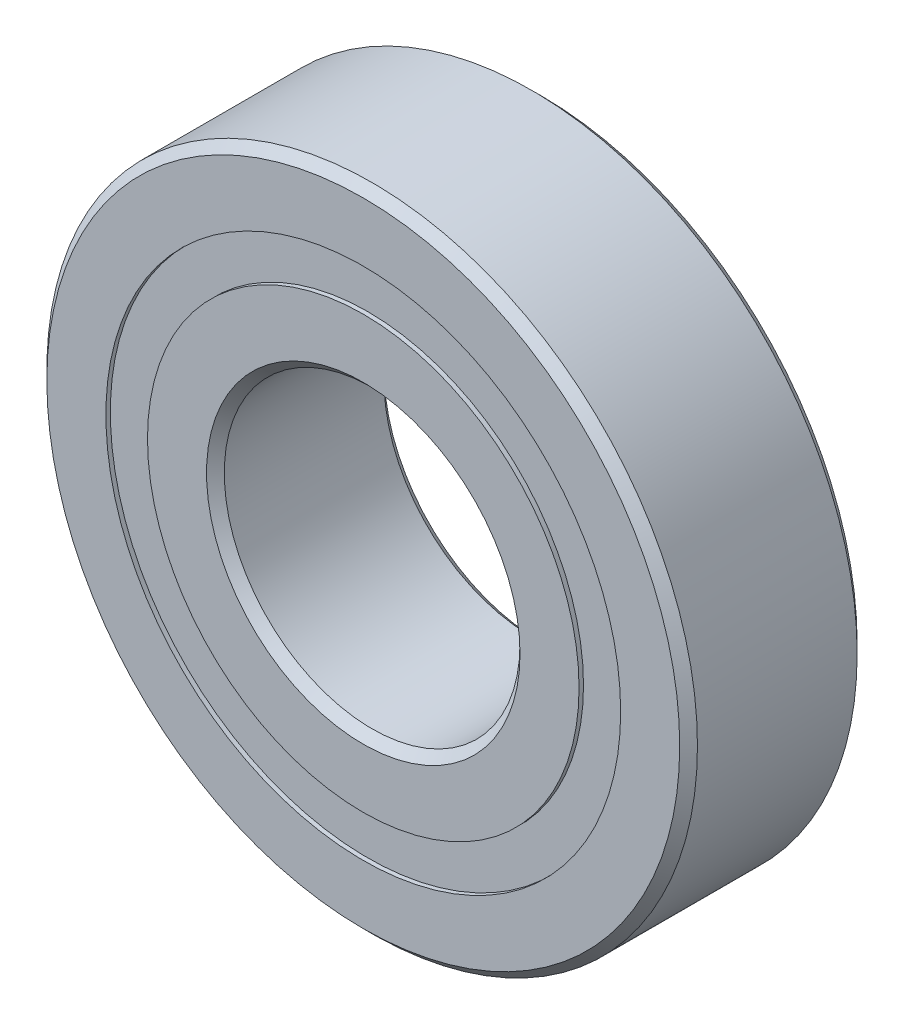
ISO-10303-21;
HEADER;
FILE_DESCRIPTION(('STEP AP214'),'2;1');
FILE_NAME('part.step','',(''),(''),'','','');
FILE_SCHEMA(('AUTOMOTIVE_DESIGN { 1 0 10303 214 1 1 1 1 }'));
ENDSEC;
DATA;
#1=APPLICATION_CONTEXT('core data for automotive mechanical design processes');
#2=APPLICATION_PROTOCOL_DEFINITION('international standard','automotive_design',2000,#1);
#3=PRODUCT_CONTEXT('',#1,'mechanical');
#4=PRODUCT('Part','Part','',(#3));
#5=PRODUCT_RELATED_PRODUCT_CATEGORY('part','',(#4));
#6=PRODUCT_DEFINITION_FORMATION('','',#4);
#7=PRODUCT_DEFINITION_CONTEXT('part definition',#1,'design');
#8=PRODUCT_DEFINITION('design','',#6,#7);
#9=PRODUCT_DEFINITION_SHAPE('','',#8);
#10=(LENGTH_UNIT() NAMED_UNIT(*) SI_UNIT(.MILLI.,.METRE.));
#11=(NAMED_UNIT(*) PLANE_ANGLE_UNIT() SI_UNIT($,.RADIAN.));
#12=(NAMED_UNIT(*) SI_UNIT($,.STERADIAN.) SOLID_ANGLE_UNIT());
#13=UNCERTAINTY_MEASURE_WITH_UNIT(LENGTH_MEASURE(1.E-05),#10,'distance_accuracy_value','');
#14=(GEOMETRIC_REPRESENTATION_CONTEXT(3) GLOBAL_UNCERTAINTY_ASSIGNED_CONTEXT((#13)) GLOBAL_UNIT_ASSIGNED_CONTEXT((#10,
#11,#12)) REPRESENTATION_CONTEXT('',''));
#15=CARTESIAN_POINT('',(0.,0.,0.));
#16=DIRECTION('',(0.,0.,1.));
#17=DIRECTION('',(1.,0.,0.));
#18=AXIS2_PLACEMENT_3D('',#15,#16,#17);
#19=CARTESIAN_POINT('',(0.,8.7032967032967,-2.85));
#20=DIRECTION('',(0.,0.,1.));
#21=DIRECTION('',(1.,0.,0.));
#22=AXIS2_PLACEMENT_3D('',#19,#20,#21);
#23=PLANE('',#22);
#24=CARTESIAN_POINT('',(0.,0.,-2.85));
#25=DIRECTION('',(0.,0.,1.));
#26=DIRECTION('',(1.,0.,0.));
#27=AXIS2_PLACEMENT_3D('',#24,#25,#26);
#28=CIRCLE('',#27,8.7032967032967);
#29=CARTESIAN_POINT('',(8.7032967032967,0.,-2.85));
#30=VERTEX_POINT('',#29);
#31=EDGE_CURVE('E57',#30,#30,#28,.T.);
#32=ORIENTED_EDGE('',*,*,#31,.F.);
#33=EDGE_LOOP('',(#32));
#34=FACE_BOUND('',#33,.T.);
#35=CARTESIAN_POINT('',(0.,0.,-2.85));
#36=DIRECTION('',(0.,0.,1.));
#37=DIRECTION('',(1.,0.,0.));
#38=AXIS2_PLACEMENT_3D('',#35,#36,#37);
#39=CIRCLE('',#38,7.2967032967033);
#40=CARTESIAN_POINT('',(7.2967032967033,0.,-2.85));
#41=VERTEX_POINT('',#40);
#42=EDGE_CURVE('E11',#41,#41,#39,.T.);
#43=ORIENTED_EDGE('',*,*,#42,.T.);
#44=EDGE_LOOP('',(#43));
#45=FACE_BOUND('',#44,.T.);
#46=ADVANCED_FACE('F43',(#34,#45),#23,.F.);
#47=CARTESIAN_POINT('',(0.,0.,3.));
#48=DIRECTION('',(0.,0.,1.));
#49=DIRECTION('',(1.,0.,0.));
#50=AXIS2_PLACEMENT_3D('',#47,#48,#49);
#51=CYLINDRICAL_SURFACE('',#50,7.2967032967033);
#52=ORIENTED_EDGE('',*,*,#42,.F.);
#53=EDGE_LOOP('',(#52));
#54=FACE_BOUND('',#53,.T.);
#55=CARTESIAN_POINT('',(0.,0.,-1.50744951180654));
#56=DIRECTION('',(0.,0.,1.));
#57=DIRECTION('',(1.,0.,0.));
#58=AXIS2_PLACEMENT_3D('',#55,#56,#57);
#59=CIRCLE('',#58,7.2967032967033);
#60=CARTESIAN_POINT('',(7.2967032967033,0.,-1.50744951180654));
#61=VERTEX_POINT('',#60);
#62=EDGE_CURVE('E49',#61,#61,#59,.T.);
#63=ORIENTED_EDGE('',*,*,#62,.T.);
#64=EDGE_LOOP('',(#63));
#65=FACE_BOUND('',#64,.T.);
#66=ADVANCED_FACE('F66',(#54,#65),#51,.F.);
#67=CARTESIAN_POINT('',(0.,8.7032967032967,-1.50744951180654));
#68=DIRECTION('',(0.,0.,-1.));
#69=DIRECTION('',(-1.,0.,0.));
#70=AXIS2_PLACEMENT_3D('',#67,#68,#69);
#71=PLANE('',#70);
#72=ORIENTED_EDGE('',*,*,#62,.F.);
#73=EDGE_LOOP('',(#72));
#74=FACE_BOUND('',#73,.T.);
#75=CARTESIAN_POINT('',(0.,0.,-1.50744951180654));
#76=DIRECTION('',(0.,0.,1.));
#77=DIRECTION('',(1.,0.,0.));
#78=AXIS2_PLACEMENT_3D('',#75,#76,#77);
#79=CIRCLE('',#78,8.7032967032967);
#80=CARTESIAN_POINT('',(8.7032967032967,0.,-1.50744951180654));
#81=VERTEX_POINT('',#80);
#82=EDGE_CURVE('E53',#81,#81,#79,.T.);
#83=ORIENTED_EDGE('',*,*,#82,.T.);
#84=EDGE_LOOP('',(#83));
#85=FACE_BOUND('',#84,.T.);
#86=ADVANCED_FACE('F70',(#74,#85),#71,.F.);
#87=CARTESIAN_POINT('',(0.,0.,3.));
#88=DIRECTION('',(0.,0.,1.));
#89=DIRECTION('',(1.,0.,0.));
#90=AXIS2_PLACEMENT_3D('',#87,#88,#89);
#91=CYLINDRICAL_SURFACE('',#90,8.7032967032967);
#92=ORIENTED_EDGE('',*,*,#82,.F.);
#93=EDGE_LOOP('',(#92));
#94=FACE_BOUND('',#93,.T.);
#95=ORIENTED_EDGE('',*,*,#31,.T.);
#96=EDGE_LOOP('',(#95));
#97=FACE_BOUND('',#96,.T.);
#98=ADVANCED_FACE('F63',(#94,#97),#91,.T.);
#99=CLOSED_SHELL('',(#46,#66,#86,#98));
#100=MANIFOLD_SOLID_BREP('B2',#99);
#101=CARTESIAN_POINT('',(0.,8.7032967032967,2.85));
#102=DIRECTION('',(0.,0.,-1.));
#103=DIRECTION('',(-1.,0.,0.));
#104=AXIS2_PLACEMENT_3D('',#101,#102,#103);
#105=PLANE('',#104);
#106=CARTESIAN_POINT('',(0.,0.,2.85));
#107=DIRECTION('',(0.,0.,1.));
#108=DIRECTION('',(1.,0.,0.));
#109=AXIS2_PLACEMENT_3D('',#106,#107,#108);
#110=CIRCLE('',#109,7.2967032967033);
#111=CARTESIAN_POINT('',(7.2967032967033,0.,2.85));
#112=VERTEX_POINT('',#111);
#113=EDGE_CURVE('E42',#112,#112,#110,.T.);
#114=ORIENTED_EDGE('',*,*,#113,.F.);
#115=EDGE_LOOP('',(#114));
#116=FACE_BOUND('',#115,.T.);
#117=CARTESIAN_POINT('',(0.,0.,2.85));
#118=DIRECTION('',(0.,0.,1.));
#119=DIRECTION('',(1.,0.,0.));
#120=AXIS2_PLACEMENT_3D('',#117,#118,#119);
#121=CIRCLE('',#120,8.7032967032967);
#122=CARTESIAN_POINT('',(8.7032967032967,0.,2.85));
#123=VERTEX_POINT('',#122);
#124=EDGE_CURVE('E124',#123,#123,#121,.T.);
#125=ORIENTED_EDGE('',*,*,#124,.T.);
#126=EDGE_LOOP('',(#125));
#127=FACE_BOUND('',#126,.T.);
#128=ADVANCED_FACE('F110',(#116,#127),#105,.F.);
#129=CARTESIAN_POINT('',(0.,0.,3.));
#130=DIRECTION('',(0.,0.,1.));
#131=DIRECTION('',(1.,0.,0.));
#132=AXIS2_PLACEMENT_3D('',#129,#130,#131);
#133=CYLINDRICAL_SURFACE('',#132,7.2967032967033);
#134=CARTESIAN_POINT('',(0.,0.,1.50744951180654));
#135=DIRECTION('',(0.,0.,1.));
#136=DIRECTION('',(1.,0.,0.));
#137=AXIS2_PLACEMENT_3D('',#134,#135,#136);
#138=CIRCLE('',#137,7.2967032967033);
#139=CARTESIAN_POINT('',(7.2967032967033,0.,1.50744951180654));
#140=VERTEX_POINT('',#139);
#141=EDGE_CURVE('E116',#140,#140,#138,.T.);
#142=ORIENTED_EDGE('',*,*,#141,.F.);
#143=EDGE_LOOP('',(#142));
#144=FACE_BOUND('',#143,.T.);
#145=ORIENTED_EDGE('',*,*,#113,.T.);
#146=EDGE_LOOP('',(#145));
#147=FACE_BOUND('',#146,.T.);
#148=ADVANCED_FACE('F139',(#144,#147),#133,.F.);
#149=CARTESIAN_POINT('',(0.,8.7032967032967,1.50744951180654));
#150=DIRECTION('',(0.,0.,1.));
#151=DIRECTION('',(1.,0.,0.));
#152=AXIS2_PLACEMENT_3D('',#149,#150,#151);
#153=PLANE('',#152);
#154=CARTESIAN_POINT('',(0.,0.,1.50744951180654));
#155=DIRECTION('',(0.,0.,1.));
#156=DIRECTION('',(1.,0.,0.));
#157=AXIS2_PLACEMENT_3D('',#154,#155,#156);
#158=CIRCLE('',#157,8.7032967032967);
#159=CARTESIAN_POINT('',(8.7032967032967,0.,1.50744951180654));
#160=VERTEX_POINT('',#159);
#161=EDGE_CURVE('E120',#160,#160,#158,.T.);
#162=ORIENTED_EDGE('',*,*,#161,.F.);
#163=EDGE_LOOP('',(#162));
#164=FACE_BOUND('',#163,.T.);
#165=ORIENTED_EDGE('',*,*,#141,.T.);
#166=EDGE_LOOP('',(#165));
#167=FACE_BOUND('',#166,.T.);
#168=ADVANCED_FACE('F134',(#164,#167),#153,.F.);
#169=CARTESIAN_POINT('',(0.,0.,3.));
#170=DIRECTION('',(0.,0.,1.));
#171=DIRECTION('',(1.,0.,0.));
#172=AXIS2_PLACEMENT_3D('',#169,#170,#171);
#173=CYLINDRICAL_SURFACE('',#172,8.7032967032967);
#174=ORIENTED_EDGE('',*,*,#124,.F.);
#175=EDGE_LOOP('',(#174));
#176=FACE_BOUND('',#175,.T.);
#177=ORIENTED_EDGE('',*,*,#161,.T.);
#178=EDGE_LOOP('',(#177));
#179=FACE_BOUND('',#178,.T.);
#180=ADVANCED_FACE('F131',(#176,#179),#173,.T.);
#181=CLOSED_SHELL('',(#128,#148,#168,#180));
#182=MANIFOLD_SOLID_BREP('B6',#181);
#183=CARTESIAN_POINT('',(-3.99999999999991,6.92820323027556,0.));
#184=DIRECTION('',(0.,0.,1.));
#185=DIRECTION('',(-0.499999999999989,0.866025403784445,0.));
#186=AXIS2_PLACEMENT_3D('',#183,#184,#185);
#187=SPHERICAL_SURFACE('',#186,1.50744951180654);
#188=CARTESIAN_POINT('',(-3.99999999999991,6.92820323027556,1.50744951180654));
#189=VERTEX_POINT('',#188);
#190=VERTEX_LOOP('',#189);
#191=FACE_BOUND('',#190,.T.);
#192=ADVANCED_FACE('F178',(#191),#187,.T.);
#193=CLOSED_SHELL('',(#192));
#194=MANIFOLD_SOLID_BREP('B37',#193);
#195=CARTESIAN_POINT('',(-6.92820323027546,4.00000000000008,0.));
#196=DIRECTION('',(0.,0.,1.));
#197=DIRECTION('',(-0.866025403784433,0.50000000000001,0.));
#198=AXIS2_PLACEMENT_3D('',#195,#196,#197);
#199=SPHERICAL_SURFACE('',#198,1.50744951180654);
#200=CARTESIAN_POINT('',(-6.92820323027546,4.00000000000008,1.50744951180654));
#201=VERTEX_POINT('',#200);
#202=VERTEX_LOOP('',#201);
#203=FACE_BOUND('',#202,.T.);
#204=ADVANCED_FACE('F201',(#203),#199,.T.);
#205=CLOSED_SHELL('',(#204));
#206=MANIFOLD_SOLID_BREP('B106',#205);
#207=CARTESIAN_POINT('',(-8.,0.,0.));
#208=DIRECTION('',(0.,0.,1.));
#209=DIRECTION('',(-1.,0.,0.));
#210=AXIS2_PLACEMENT_3D('',#207,#208,#209);
#211=SPHERICAL_SURFACE('',#210,1.50744951180654);
#212=CARTESIAN_POINT('',(-8.,0.,1.50744951180654));
#213=VERTEX_POINT('',#212);
#214=VERTEX_LOOP('',#213);
#215=FACE_BOUND('',#214,.T.);
#216=ADVANCED_FACE('F221',(#215),#211,.T.);
#217=CLOSED_SHELL('',(#216));
#218=MANIFOLD_SOLID_BREP('B174',#217);
#219=CARTESIAN_POINT('',(-6.92820323027555,-3.99999999999994,0.));
#220=DIRECTION('',(0.,0.,1.));
#221=DIRECTION('',(-0.866025403784443,-0.499999999999992,0.));
#222=AXIS2_PLACEMENT_3D('',#219,#220,#221);
#223=SPHERICAL_SURFACE('',#222,1.50744951180654);
#224=CARTESIAN_POINT('',(-6.92820323027555,-3.99999999999994,1.50744951180654));
#225=VERTEX_POINT('',#224);
#226=VERTEX_LOOP('',#225);
#227=FACE_BOUND('',#226,.T.);
#228=ADVANCED_FACE('F241',(#227),#223,.T.);
#229=CLOSED_SHELL('',(#228));
#230=MANIFOLD_SOLID_BREP('B197',#229);
#231=CARTESIAN_POINT('',(-4.00000000000006,-6.92820323027548,0.));
#232=DIRECTION('',(0.,0.,1.));
#233=DIRECTION('',(-0.500000000000007,-0.866025403784435,0.));
#234=AXIS2_PLACEMENT_3D('',#231,#232,#233);
#235=SPHERICAL_SURFACE('',#234,1.50744951180654);
#236=CARTESIAN_POINT('',(-4.00000000000006,-6.92820323027548,1.50744951180654));
#237=VERTEX_POINT('',#236);
#238=VERTEX_LOOP('',#237);
#239=FACE_BOUND('',#238,.T.);
#240=ADVANCED_FACE('F261',(#239),#235,.T.);
#241=CLOSED_SHELL('',(#240));
#242=MANIFOLD_SOLID_BREP('B217',#241);
#243=CARTESIAN_POINT('',(0.,-8.,0.));
#244=DIRECTION('',(0.,0.,1.));
#245=DIRECTION('',(0.,-1.,0.));
#246=AXIS2_PLACEMENT_3D('',#243,#244,#245);
#247=SPHERICAL_SURFACE('',#246,1.50744951180654);
#248=CARTESIAN_POINT('',(0.,-8.,1.50744951180654));
#249=VERTEX_POINT('',#248);
#250=VERTEX_LOOP('',#249);
#251=FACE_BOUND('',#250,.T.);
#252=ADVANCED_FACE('F281',(#251),#247,.T.);
#253=CLOSED_SHELL('',(#252));
#254=MANIFOLD_SOLID_BREP('B237',#253);
#255=CARTESIAN_POINT('',(3.99999999999996,-6.92820323027553,0.));
#256=DIRECTION('',(0.,0.,1.));
#257=DIRECTION('',(0.499999999999995,-0.866025403784442,0.));
#258=AXIS2_PLACEMENT_3D('',#255,#256,#257);
#259=SPHERICAL_SURFACE('',#258,1.50744951180654);
#260=CARTESIAN_POINT('',(3.99999999999996,-6.92820323027553,1.50744951180654));
#261=VERTEX_POINT('',#260);
#262=VERTEX_LOOP('',#261);
#263=FACE_BOUND('',#262,.T.);
#264=ADVANCED_FACE('F301',(#263),#259,.T.);
#265=CLOSED_SHELL('',(#264));
#266=MANIFOLD_SOLID_BREP('B257',#265);
#267=CARTESIAN_POINT('',(6.92820323027549,-4.00000000000003,0.));
#268=DIRECTION('',(0.,0.,1.));
#269=DIRECTION('',(0.866025403784436,-0.500000000000004,0.));
#270=AXIS2_PLACEMENT_3D('',#267,#268,#269);
#271=SPHERICAL_SURFACE('',#270,1.50744951180654);
#272=CARTESIAN_POINT('',(6.92820323027549,-4.00000000000003,1.50744951180654));
#273=VERTEX_POINT('',#272);
#274=VERTEX_LOOP('',#273);
#275=FACE_BOUND('',#274,.T.);
#276=ADVANCED_FACE('F321',(#275),#271,.T.);
#277=CLOSED_SHELL('',(#276));
#278=MANIFOLD_SOLID_BREP('B277',#277);
#279=CARTESIAN_POINT('',(8.,0.,0.));
#280=DIRECTION('',(0.,0.,1.));
#281=DIRECTION('',(1.,0.,0.));
#282=AXIS2_PLACEMENT_3D('',#279,#280,#281);
#283=SPHERICAL_SURFACE('',#282,1.50744951180654);
#284=CARTESIAN_POINT('',(8.,0.,1.50744951180654));
#285=VERTEX_POINT('',#284);
#286=VERTEX_LOOP('',#285);
#287=FACE_BOUND('',#286,.T.);
#288=ADVANCED_FACE('F341',(#287),#283,.T.);
#289=CLOSED_SHELL('',(#288));
#290=MANIFOLD_SOLID_BREP('B297',#289);
#291=CARTESIAN_POINT('',(6.92820323027552,3.99999999999998,0.));
#292=DIRECTION('',(0.,0.,1.));
#293=DIRECTION('',(0.86602540378444,0.499999999999998,0.));
#294=AXIS2_PLACEMENT_3D('',#291,#292,#293);
#295=SPHERICAL_SURFACE('',#294,1.50744951180654);
#296=CARTESIAN_POINT('',(6.92820323027552,3.99999999999998,1.50744951180654));
#297=VERTEX_POINT('',#296);
#298=VERTEX_LOOP('',#297);
#299=FACE_BOUND('',#298,.T.);
#300=ADVANCED_FACE('F361',(#299),#295,.T.);
#301=CLOSED_SHELL('',(#300));
#302=MANIFOLD_SOLID_BREP('B317',#301);
#303=CARTESIAN_POINT('',(4.00000000000001,6.9282032302755,0.));
#304=DIRECTION('',(0.,0.,1.));
#305=DIRECTION('',(0.500000000000001,0.866025403784438,0.));
#306=AXIS2_PLACEMENT_3D('',#303,#304,#305);
#307=SPHERICAL_SURFACE('',#306,1.50744951180654);
#308=CARTESIAN_POINT('',(4.00000000000001,6.9282032302755,1.50744951180654));
#309=VERTEX_POINT('',#308);
#310=VERTEX_LOOP('',#309);
#311=FACE_BOUND('',#310,.T.);
#312=ADVANCED_FACE('F381',(#311),#307,.T.);
#313=CLOSED_SHELL('',(#312));
#314=MANIFOLD_SOLID_BREP('B337',#313);
#315=CARTESIAN_POINT('',(0.,8.,0.));
#316=DIRECTION('',(0.,0.,1.));
#317=DIRECTION('',(0.,1.,0.));
#318=AXIS2_PLACEMENT_3D('',#315,#316,#317);
#319=SPHERICAL_SURFACE('',#318,1.50744951180654);
#320=CARTESIAN_POINT('',(0.,8.,1.50744951180654));
#321=VERTEX_POINT('',#320);
#322=VERTEX_LOOP('',#321);
#323=FACE_BOUND('',#322,.T.);
#324=ADVANCED_FACE('F404',(#323),#319,.T.);
#325=CLOSED_SHELL('',(#324));
#326=MANIFOLD_SOLID_BREP('B357',#325);
#327=CARTESIAN_POINT('',(0.,7.2967032967033,3.));
#328=DIRECTION('',(0.,0.,-1.));
#329=DIRECTION('',(-1.,0.,0.));
#330=AXIS2_PLACEMENT_3D('',#327,#328,#329);
#331=PLANE('',#330);
#332=CARTESIAN_POINT('',(0.,0.,3.));
#333=DIRECTION('',(0.,0.,1.));
#334=DIRECTION('',(1.,0.,0.));
#335=AXIS2_PLACEMENT_3D('',#332,#333,#334);
#336=CIRCLE('',#335,5.3);
#337=CARTESIAN_POINT('',(5.3,0.,3.));
#338=VERTEX_POINT('',#337);
#339=EDGE_CURVE('E455',#338,#338,#336,.T.);
#340=ORIENTED_EDGE('',*,*,#339,.F.);
#341=EDGE_LOOP('',(#340));
#342=FACE_BOUND('',#341,.T.);
#343=CARTESIAN_POINT('',(0.,0.,3.));
#344=DIRECTION('',(0.,0.,1.));
#345=DIRECTION('',(1.,0.,0.));
#346=AXIS2_PLACEMENT_3D('',#343,#344,#345);
#347=CIRCLE('',#346,7.2967032967033);
#348=CARTESIAN_POINT('',(7.2967032967033,0.,3.));
#349=VERTEX_POINT('',#348);
#350=EDGE_CURVE('E403',#349,#349,#347,.T.);
#351=ORIENTED_EDGE('',*,*,#350,.T.);
#352=EDGE_LOOP('',(#351));
#353=FACE_BOUND('',#352,.T.);
#354=ADVANCED_FACE('F427',(#342,#353),#331,.F.);
#355=CARTESIAN_POINT('',(0.,0.,3.));
#356=DIRECTION('',(0.,0.,1.));
#357=DIRECTION('',(1.,0.,0.));
#358=AXIS2_PLACEMENT_3D('',#355,#356,#357);
#359=CYLINDRICAL_SURFACE('',#358,7.2967032967033);
#360=ORIENTED_EDGE('',*,*,#350,.F.);
#361=EDGE_LOOP('',(#360));
#362=FACE_BOUND('',#361,.T.);
#363=CARTESIAN_POINT('',(0.,0.,1.33333333333333));
#364=DIRECTION('',(0.,0.,1.));
#365=DIRECTION('',(1.,0.,0.));
#366=AXIS2_PLACEMENT_3D('',#363,#364,#365);
#367=CIRCLE('',#366,7.2967032967033);
#368=CARTESIAN_POINT('',(7.2967032967033,0.,1.33333333333333));
#369=VERTEX_POINT('',#368);
#370=EDGE_CURVE('E433',#369,#369,#367,.T.);
#371=ORIENTED_EDGE('',*,*,#370,.T.);
#372=EDGE_LOOP('',(#371));
#373=FACE_BOUND('',#372,.T.);
#374=ADVANCED_FACE('F462',(#362,#373),#359,.T.);
#375=CARTESIAN_POINT('',(0.,0.,0.));
#376=DIRECTION('',(0.,0.,1.));
#377=DIRECTION('',(1.,0.,0.));
#378=AXIS2_PLACEMENT_3D('',#375,#376,#377);
#379=TOROIDAL_SURFACE('',#378,8.,1.50744951180654);
#380=ORIENTED_EDGE('',*,*,#370,.F.);
#381=EDGE_LOOP('',(#380));
#382=FACE_BOUND('',#381,.T.);
#383=CARTESIAN_POINT('',(0.,0.,-1.33333333333333));
#384=DIRECTION('',(0.,0.,1.));
#385=DIRECTION('',(1.,0.,0.));
#386=AXIS2_PLACEMENT_3D('',#383,#384,#385);
#387=CIRCLE('',#386,7.2967032967033);
#388=CARTESIAN_POINT('',(7.2967032967033,0.,-1.33333333333333));
#389=VERTEX_POINT('',#388);
#390=EDGE_CURVE('E437',#389,#389,#387,.T.);
#391=ORIENTED_EDGE('',*,*,#390,.T.);
#392=EDGE_LOOP('',(#391));
#393=FACE_BOUND('',#392,.T.);
#394=ADVANCED_FACE('F466',(#382,#393),#379,.F.);
#395=CARTESIAN_POINT('',(0.,0.,3.));
#396=DIRECTION('',(0.,0.,1.));
#397=DIRECTION('',(1.,0.,0.));
#398=AXIS2_PLACEMENT_3D('',#395,#396,#397);
#399=CYLINDRICAL_SURFACE('',#398,7.2967032967033);
#400=ORIENTED_EDGE('',*,*,#390,.F.);
#401=EDGE_LOOP('',(#400));
#402=FACE_BOUND('',#401,.T.);
#403=CARTESIAN_POINT('',(0.,0.,-3.));
#404=DIRECTION('',(0.,0.,1.));
#405=DIRECTION('',(1.,0.,0.));
#406=AXIS2_PLACEMENT_3D('',#403,#404,#405);
#407=CIRCLE('',#406,7.2967032967033);
#408=CARTESIAN_POINT('',(7.2967032967033,0.,-3.));
#409=VERTEX_POINT('',#408);
#410=EDGE_CURVE('E441',#409,#409,#407,.T.);
#411=ORIENTED_EDGE('',*,*,#410,.T.);
#412=EDGE_LOOP('',(#411));
#413=FACE_BOUND('',#412,.T.);
#414=ADVANCED_FACE('F471',(#402,#413),#399,.T.);
#415=CARTESIAN_POINT('',(0.,5.3,-3.));
#416=DIRECTION('',(0.,0.,1.));
#417=DIRECTION('',(1.,0.,0.));
#418=AXIS2_PLACEMENT_3D('',#415,#416,#417);
#419=PLANE('',#418);
#420=ORIENTED_EDGE('',*,*,#410,.F.);
#421=EDGE_LOOP('',(#420));
#422=FACE_BOUND('',#421,.T.);
#423=CARTESIAN_POINT('',(0.,0.,-3.));
#424=DIRECTION('',(0.,0.,1.));
#425=DIRECTION('',(1.,0.,0.));
#426=AXIS2_PLACEMENT_3D('',#423,#424,#425);
#427=CIRCLE('',#426,5.3);
#428=CARTESIAN_POINT('',(5.3,0.,-3.));
#429=VERTEX_POINT('',#428);
#430=EDGE_CURVE('E446',#429,#429,#427,.T.);
#431=ORIENTED_EDGE('',*,*,#430,.T.);
#432=EDGE_LOOP('',(#431));
#433=FACE_BOUND('',#432,.T.);
#434=ADVANCED_FACE('F477',(#422,#433),#419,.F.);
#435=CARTESIAN_POINT('',(0.,0.,-2.7));
#436=DIRECTION('',(0.,0.,-1.));
#437=DIRECTION('',(-1.,0.,0.));
#438=AXIS2_PLACEMENT_3D('',#435,#436,#437);
#439=CONICAL_SURFACE('',#438,5.,0.785398163397447);
#440=ORIENTED_EDGE('',*,*,#430,.F.);
#441=EDGE_LOOP('',(#440));
#442=FACE_BOUND('',#441,.T.);
#443=CARTESIAN_POINT('',(0.,0.,-2.7));
#444=DIRECTION('',(0.,0.,1.));
#445=DIRECTION('',(1.,0.,0.));
#446=AXIS2_PLACEMENT_3D('',#443,#444,#445);
#447=CIRCLE('',#446,5.);
#448=CARTESIAN_POINT('',(5.,0.,-2.7));
#449=VERTEX_POINT('',#448);
#450=EDGE_CURVE('E449',#449,#449,#447,.T.);
#451=ORIENTED_EDGE('',*,*,#450,.T.);
#452=EDGE_LOOP('',(#451));
#453=FACE_BOUND('',#452,.T.);
#454=ADVANCED_FACE('F481',(#442,#453),#439,.F.);
#455=CARTESIAN_POINT('',(0.,0.,3.));
#456=DIRECTION('',(0.,0.,1.));
#457=DIRECTION('',(1.,0.,0.));
#458=AXIS2_PLACEMENT_3D('',#455,#456,#457);
#459=CYLINDRICAL_SURFACE('',#458,5.);
#460=ORIENTED_EDGE('',*,*,#450,.F.);
#461=EDGE_LOOP('',(#460));
#462=FACE_BOUND('',#461,.T.);
#463=CARTESIAN_POINT('',(0.,0.,2.7));
#464=DIRECTION('',(0.,0.,1.));
#465=DIRECTION('',(1.,0.,0.));
#466=AXIS2_PLACEMENT_3D('',#463,#464,#465);
#467=CIRCLE('',#466,5.);
#468=CARTESIAN_POINT('',(5.,0.,2.7));
#469=VERTEX_POINT('',#468);
#470=EDGE_CURVE('E452',#469,#469,#467,.T.);
#471=ORIENTED_EDGE('',*,*,#470,.T.);
#472=EDGE_LOOP('',(#471));
#473=FACE_BOUND('',#472,.T.);
#474=ADVANCED_FACE('F485',(#462,#473),#459,.F.);
#475=CARTESIAN_POINT('',(0.,0.,3.));
#476=DIRECTION('',(0.,0.,1.));
#477=DIRECTION('',(1.,0.,0.));
#478=AXIS2_PLACEMENT_3D('',#475,#476,#477);
#479=CONICAL_SURFACE('',#478,5.3,0.78539816339745);
#480=ORIENTED_EDGE('',*,*,#470,.F.);
#481=EDGE_LOOP('',(#480));
#482=FACE_BOUND('',#481,.T.);
#483=ORIENTED_EDGE('',*,*,#339,.T.);
#484=EDGE_LOOP('',(#483));
#485=FACE_BOUND('',#484,.T.);
#486=ADVANCED_FACE('F459',(#482,#485),#479,.F.);
#487=CLOSED_SHELL('',(#354,#374,#394,#414,#434,#454,#474,#486));
#488=MANIFOLD_SOLID_BREP('B377',#487);
#489=CARTESIAN_POINT('',(0.,0.,2.7));
#490=DIRECTION('',(0.,0.,-1.));
#491=DIRECTION('',(-1.,0.,0.));
#492=AXIS2_PLACEMENT_3D('',#489,#490,#491);
#493=CONICAL_SURFACE('',#492,11.,0.785398163397445);
#494=CARTESIAN_POINT('',(0.,0.,3.));
#495=DIRECTION('',(0.,0.,1.));
#496=DIRECTION('',(1.,0.,0.));
#497=AXIS2_PLACEMENT_3D('',#494,#495,#496);
#498=CIRCLE('',#497,10.7);
#499=CARTESIAN_POINT('',(10.7,0.,3.));
#500=VERTEX_POINT('',#499);
#501=EDGE_CURVE('E579',#500,#500,#498,.T.);
#502=ORIENTED_EDGE('',*,*,#501,.F.);
#503=EDGE_LOOP('',(#502));
#504=FACE_BOUND('',#503,.T.);
#505=CARTESIAN_POINT('',(0.,0.,2.7));
#506=DIRECTION('',(0.,0.,1.));
#507=DIRECTION('',(1.,0.,0.));
#508=AXIS2_PLACEMENT_3D('',#505,#506,#507);
#509=CIRCLE('',#508,11.);
#510=CARTESIAN_POINT('',(11.,0.,2.7));
#511=VERTEX_POINT('',#510);
#512=EDGE_CURVE('E426',#511,#511,#509,.T.);
#513=ORIENTED_EDGE('',*,*,#512,.T.);
#514=EDGE_LOOP('',(#513));
#515=FACE_BOUND('',#514,.T.);
#516=ADVANCED_FACE('F551',(#504,#515),#493,.T.);
#517=CARTESIAN_POINT('',(0.,0.,3.));
#518=DIRECTION('',(0.,0.,1.));
#519=DIRECTION('',(1.,0.,0.));
#520=AXIS2_PLACEMENT_3D('',#517,#518,#519);
#521=CYLINDRICAL_SURFACE('',#520,11.);
#522=ORIENTED_EDGE('',*,*,#512,.F.);
#523=EDGE_LOOP('',(#522));
#524=FACE_BOUND('',#523,.T.);
#525=CARTESIAN_POINT('',(0.,0.,-2.7));
#526=DIRECTION('',(0.,0.,1.));
#527=DIRECTION('',(1.,0.,0.));
#528=AXIS2_PLACEMENT_3D('',#525,#526,#527);
#529=CIRCLE('',#528,11.);
#530=CARTESIAN_POINT('',(11.,0.,-2.7));
#531=VERTEX_POINT('',#530);
#532=EDGE_CURVE('E557',#531,#531,#529,.T.);
#533=ORIENTED_EDGE('',*,*,#532,.T.);
#534=EDGE_LOOP('',(#533));
#535=FACE_BOUND('',#534,.T.);
#536=ADVANCED_FACE('F586',(#524,#535),#521,.T.);
#537=CARTESIAN_POINT('',(0.,0.,-3.));
#538=DIRECTION('',(0.,0.,1.));
#539=DIRECTION('',(1.,0.,0.));
#540=AXIS2_PLACEMENT_3D('',#537,#538,#539);
#541=CONICAL_SURFACE('',#540,10.7,0.785398163397445);
#542=ORIENTED_EDGE('',*,*,#532,.F.);
#543=EDGE_LOOP('',(#542));
#544=FACE_BOUND('',#543,.T.);
#545=CARTESIAN_POINT('',(0.,0.,-3.));
#546=DIRECTION('',(0.,0.,1.));
#547=DIRECTION('',(1.,0.,0.));
#548=AXIS2_PLACEMENT_3D('',#545,#546,#547);
#549=CIRCLE('',#548,10.7);
#550=CARTESIAN_POINT('',(10.7,0.,-3.));
#551=VERTEX_POINT('',#550);
#552=EDGE_CURVE('E561',#551,#551,#549,.T.);
#553=ORIENTED_EDGE('',*,*,#552,.T.);
#554=EDGE_LOOP('',(#553));
#555=FACE_BOUND('',#554,.T.);
#556=ADVANCED_FACE('F590',(#544,#555),#541,.T.);
#557=CARTESIAN_POINT('',(0.,10.7,-3.));
#558=DIRECTION('',(0.,0.,1.));
#559=DIRECTION('',(1.,0.,0.));
#560=AXIS2_PLACEMENT_3D('',#557,#558,#559);
#561=PLANE('',#560);
#562=ORIENTED_EDGE('',*,*,#552,.F.);
#563=EDGE_LOOP('',(#562));
#564=FACE_BOUND('',#563,.T.);
#565=CARTESIAN_POINT('',(0.,0.,-3.));
#566=DIRECTION('',(0.,0.,1.));
#567=DIRECTION('',(1.,0.,0.));
#568=AXIS2_PLACEMENT_3D('',#565,#566,#567);
#569=CIRCLE('',#568,8.7032967032967);
#570=CARTESIAN_POINT('',(8.7032967032967,0.,-3.));
#571=VERTEX_POINT('',#570);
#572=EDGE_CURVE('E565',#571,#571,#569,.T.);
#573=ORIENTED_EDGE('',*,*,#572,.T.);
#574=EDGE_LOOP('',(#573));
#575=FACE_BOUND('',#574,.T.);
#576=ADVANCED_FACE('F595',(#564,#575),#561,.F.);
#577=CARTESIAN_POINT('',(0.,0.,3.));
#578=DIRECTION('',(0.,0.,1.));
#579=DIRECTION('',(1.,0.,0.));
#580=AXIS2_PLACEMENT_3D('',#577,#578,#579);
#581=CYLINDRICAL_SURFACE('',#580,8.7032967032967);
#582=ORIENTED_EDGE('',*,*,#572,.F.);
#583=EDGE_LOOP('',(#582));
#584=FACE_BOUND('',#583,.T.);
#585=CARTESIAN_POINT('',(0.,0.,-1.33333333333333));
#586=DIRECTION('',(0.,0.,1.));
#587=DIRECTION('',(1.,0.,0.));
#588=AXIS2_PLACEMENT_3D('',#585,#586,#587);
#589=CIRCLE('',#588,8.7032967032967);
#590=CARTESIAN_POINT('',(8.7032967032967,0.,-1.33333333333333));
#591=VERTEX_POINT('',#590);
#592=EDGE_CURVE('E570',#591,#591,#589,.T.);
#593=ORIENTED_EDGE('',*,*,#592,.T.);
#594=EDGE_LOOP('',(#593));
#595=FACE_BOUND('',#594,.T.);
#596=ADVANCED_FACE('F601',(#584,#595),#581,.F.);
#597=CARTESIAN_POINT('',(0.,0.,0.));
#598=DIRECTION('',(0.,0.,1.));
#599=DIRECTION('',(1.,0.,0.));
#600=AXIS2_PLACEMENT_3D('',#597,#598,#599);
#601=TOROIDAL_SURFACE('',#600,8.,1.50744951180654);
#602=ORIENTED_EDGE('',*,*,#592,.F.);
#603=EDGE_LOOP('',(#602));
#604=FACE_BOUND('',#603,.T.);
#605=CARTESIAN_POINT('',(0.,0.,1.33333333333333));
#606=DIRECTION('',(0.,0.,1.));
#607=DIRECTION('',(1.,0.,0.));
#608=AXIS2_PLACEMENT_3D('',#605,#606,#607);
#609=CIRCLE('',#608,8.7032967032967);
#610=CARTESIAN_POINT('',(8.7032967032967,0.,1.33333333333333));
#611=VERTEX_POINT('',#610);
#612=EDGE_CURVE('E573',#611,#611,#609,.T.);
#613=ORIENTED_EDGE('',*,*,#612,.T.);
#614=EDGE_LOOP('',(#613));
#615=FACE_BOUND('',#614,.T.);
#616=ADVANCED_FACE('F605',(#604,#615),#601,.F.);
#617=CARTESIAN_POINT('',(0.,0.,3.));
#618=DIRECTION('',(0.,0.,1.));
#619=DIRECTION('',(1.,0.,0.));
#620=AXIS2_PLACEMENT_3D('',#617,#618,#619);
#621=CYLINDRICAL_SURFACE('',#620,8.7032967032967);
#622=ORIENTED_EDGE('',*,*,#612,.F.);
#623=EDGE_LOOP('',(#622));
#624=FACE_BOUND('',#623,.T.);
#625=CARTESIAN_POINT('',(0.,0.,3.));
#626=DIRECTION('',(0.,0.,1.));
#627=DIRECTION('',(1.,0.,0.));
#628=AXIS2_PLACEMENT_3D('',#625,#626,#627);
#629=CIRCLE('',#628,8.7032967032967);
#630=CARTESIAN_POINT('',(8.7032967032967,0.,3.));
#631=VERTEX_POINT('',#630);
#632=EDGE_CURVE('E576',#631,#631,#629,.T.);
#633=ORIENTED_EDGE('',*,*,#632,.T.);
#634=EDGE_LOOP('',(#633));
#635=FACE_BOUND('',#634,.T.);
#636=ADVANCED_FACE('F609',(#624,#635),#621,.F.);
#637=CARTESIAN_POINT('',(0.,10.7,3.));
#638=DIRECTION('',(0.,0.,-1.));
#639=DIRECTION('',(-1.,0.,0.));
#640=AXIS2_PLACEMENT_3D('',#637,#638,#639);
#641=PLANE('',#640);
#642=ORIENTED_EDGE('',*,*,#632,.F.);
#643=EDGE_LOOP('',(#642));
#644=FACE_BOUND('',#643,.T.);
#645=ORIENTED_EDGE('',*,*,#501,.T.);
#646=EDGE_LOOP('',(#645));
#647=FACE_BOUND('',#646,.T.);
#648=ADVANCED_FACE('F583',(#644,#647),#641,.F.);
#649=CLOSED_SHELL('',(#516,#536,#556,#576,#596,#616,#636,#648));
#650=MANIFOLD_SOLID_BREP('B398',#649);
#651=ADVANCED_BREP_SHAPE_REPRESENTATION('',(#18,#100,#182,#194,#206,#218,#230,#242,#254,#266,
#278,#290,#302,#314,#326,#488,#650),#14);
#652=SHAPE_DEFINITION_REPRESENTATION(#9,#651);
ENDSEC;
END-ISO-10303-21;
